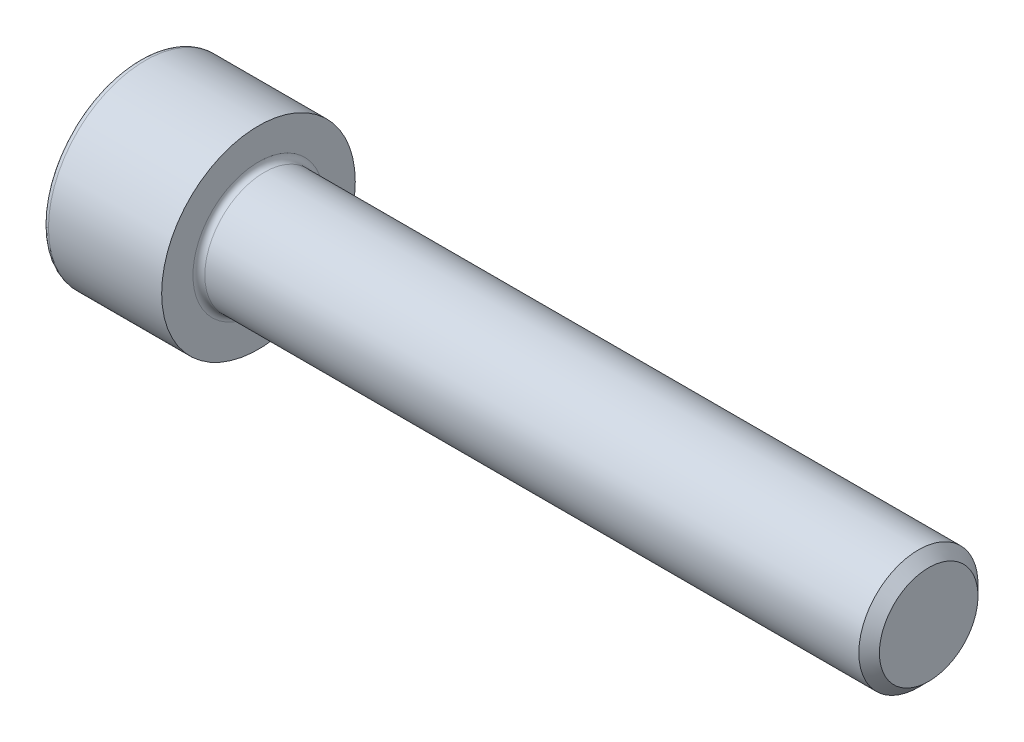
ISO-10303-21;
HEADER;
FILE_DESCRIPTION(('STEP AP214'),'2;1');
FILE_NAME('part.step','',(''),(''),'','','');
FILE_SCHEMA(('AUTOMOTIVE_DESIGN { 1 0 10303 214 1 1 1 1 }'));
ENDSEC;
DATA;
#1=APPLICATION_CONTEXT('core data for automotive mechanical design processes');
#2=APPLICATION_PROTOCOL_DEFINITION('international standard','automotive_design',2000,#1);
#3=PRODUCT_CONTEXT('',#1,'mechanical');
#4=PRODUCT('Part','Part','',(#3));
#5=PRODUCT_RELATED_PRODUCT_CATEGORY('part','',(#4));
#6=PRODUCT_DEFINITION_FORMATION('','',#4);
#7=PRODUCT_DEFINITION_CONTEXT('part definition',#1,'design');
#8=PRODUCT_DEFINITION('design','',#6,#7);
#9=PRODUCT_DEFINITION_SHAPE('','',#8);
#10=(LENGTH_UNIT() NAMED_UNIT(*) SI_UNIT(.MILLI.,.METRE.));
#11=(NAMED_UNIT(*) PLANE_ANGLE_UNIT() SI_UNIT($,.RADIAN.));
#12=(NAMED_UNIT(*) SI_UNIT($,.STERADIAN.) SOLID_ANGLE_UNIT());
#13=UNCERTAINTY_MEASURE_WITH_UNIT(LENGTH_MEASURE(1.E-05),#10,'distance_accuracy_value','');
#14=(GEOMETRIC_REPRESENTATION_CONTEXT(3) GLOBAL_UNCERTAINTY_ASSIGNED_CONTEXT((#13)) GLOBAL_UNIT_ASSIGNED_CONTEXT((#10,
#11,#12)) REPRESENTATION_CONTEXT('',''));
#15=CARTESIAN_POINT('',(0.,0.,0.));
#16=DIRECTION('',(0.,0.,1.));
#17=DIRECTION('',(1.,0.,0.));
#18=AXIS2_PLACEMENT_3D('',#15,#16,#17);
#19=CARTESIAN_POINT('',(0.,0.,0.));
#20=DIRECTION('',(-1.,0.,0.));
#21=DIRECTION('',(0.,0.,1.));
#22=AXIS2_PLACEMENT_3D('',#19,#20,#21);
#23=PLANE('',#22);
#24=DIRECTION('',(0.,-0.499999999999999,0.866025403784439));
#25=VECTOR('',#24,1.);
#26=CARTESIAN_POINT('',(0.,3.51894989071077,0.));
#27=LINE('',#26,#25);
#28=CARTESIAN_POINT('',(0.,3.51894989071077,0.));
#29=VERTEX_POINT('',#28);
#30=CARTESIAN_POINT('',(0.,1.75947494535538,3.0475));
#31=VERTEX_POINT('',#30);
#32=EDGE_CURVE('E259',#29,#31,#27,.T.);
#33=ORIENTED_EDGE('',*,*,#32,.T.);
#34=DIRECTION('',(0.,1.,0.));
#35=VECTOR('',#34,1.);
#36=CARTESIAN_POINT('',(0.,-1.75947494535538,3.0475));
#37=LINE('',#36,#35);
#38=CARTESIAN_POINT('',(0.,-1.75947494535538,3.0475));
#39=VERTEX_POINT('',#38);
#40=EDGE_CURVE('E131',#39,#31,#37,.T.);
#41=ORIENTED_EDGE('',*,*,#40,.F.);
#42=DIRECTION('',(0.,-0.500000000000001,-0.866025403784438));
#43=VECTOR('',#42,1.);
#44=CARTESIAN_POINT('',(0.,-1.75947494535538,3.0475));
#45=LINE('',#44,#43);
#46=CARTESIAN_POINT('',(0.,-3.51894989071077,0.));
#47=VERTEX_POINT('',#46);
#48=EDGE_CURVE('E262',#39,#47,#45,.T.);
#49=ORIENTED_EDGE('',*,*,#48,.T.);
#50=DIRECTION('',(0.,0.499999999999999,-0.866025403784439));
#51=VECTOR('',#50,1.);
#52=CARTESIAN_POINT('',(0.,-3.51894989071077,0.));
#53=LINE('',#52,#51);
#54=CARTESIAN_POINT('',(0.,-1.75947494535539,-3.0475));
#55=VERTEX_POINT('',#54);
#56=EDGE_CURVE('E265',#47,#55,#53,.T.);
#57=ORIENTED_EDGE('',*,*,#56,.T.);
#58=DIRECTION('',(0.,-1.,0.));
#59=VECTOR('',#58,1.);
#60=CARTESIAN_POINT('',(0.,1.75947494535538,-3.0475));
#61=LINE('',#60,#59);
#62=CARTESIAN_POINT('',(0.,1.75947494535538,-3.0475));
#63=VERTEX_POINT('',#62);
#64=EDGE_CURVE('E268',#63,#55,#61,.T.);
#65=ORIENTED_EDGE('',*,*,#64,.F.);
#66=DIRECTION('',(0.,-0.500000000000001,-0.866025403784438));
#67=VECTOR('',#66,1.);
#68=CARTESIAN_POINT('',(0.,3.51894989071077,0.));
#69=LINE('',#68,#67);
#70=EDGE_CURVE('E126',#29,#63,#69,.T.);
#71=ORIENTED_EDGE('',*,*,#70,.F.);
#72=EDGE_LOOP('',(#33,#41,#49,#57,#65,#71));
#73=FACE_BOUND('',#72,.T.);
#74=CARTESIAN_POINT('',(0.,0.,0.));
#75=DIRECTION('',(-1.,0.,0.));
#76=DIRECTION('',(0.,0.,1.));
#77=AXIS2_PLACEMENT_3D('',#74,#75,#76);
#78=CIRCLE('',#77,6.1);
#79=CARTESIAN_POINT('',(0.,0.,6.1));
#80=VERTEX_POINT('',#79);
#81=EDGE_CURVE('E43',#80,#80,#78,.T.);
#82=ORIENTED_EDGE('',*,*,#81,.T.);
#83=EDGE_LOOP('',(#82));
#84=FACE_BOUND('',#83,.T.);
#85=ADVANCED_FACE('F35',(#73,#84),#23,.T.);
#86=CARTESIAN_POINT('',(-31.75,0.,0.));
#87=DIRECTION('',(-1.,0.,0.));
#88=DIRECTION('',(0.,0.,1.));
#89=AXIS2_PLACEMENT_3D('',#86,#87,#88);
#90=CYLINDRICAL_SURFACE('',#89,6.5);
#91=CARTESIAN_POINT('',(0.399999999999998,0.,0.));
#92=DIRECTION('',(-1.,0.,0.));
#93=DIRECTION('',(0.,0.,1.));
#94=AXIS2_PLACEMENT_3D('',#91,#92,#93);
#95=CIRCLE('',#94,6.5);
#96=CARTESIAN_POINT('',(0.399999999999998,0.,6.5));
#97=VERTEX_POINT('',#96);
#98=EDGE_CURVE('E11',#97,#97,#95,.F.);
#99=ORIENTED_EDGE('',*,*,#98,.T.);
#100=EDGE_LOOP('',(#99));
#101=FACE_BOUND('',#100,.T.);
#102=CARTESIAN_POINT('',(8.,0.,0.));
#103=DIRECTION('',(-1.,0.,0.));
#104=DIRECTION('',(0.,0.,1.));
#105=AXIS2_PLACEMENT_3D('',#102,#103,#104);
#106=CIRCLE('',#105,6.5);
#107=CARTESIAN_POINT('',(8.,0.,6.5));
#108=VERTEX_POINT('',#107);
#109=EDGE_CURVE('E149',#108,#108,#106,.T.);
#110=ORIENTED_EDGE('',*,*,#109,.T.);
#111=EDGE_LOOP('',(#110));
#112=FACE_BOUND('',#111,.T.);
#113=ADVANCED_FACE('F173',(#101,#112),#90,.T.);
#114=CARTESIAN_POINT('',(8.,6.5,0.));
#115=DIRECTION('',(1.,0.,0.));
#116=DIRECTION('',(0.,0.,-1.));
#117=AXIS2_PLACEMENT_3D('',#114,#115,#116);
#118=PLANE('',#117);
#119=CARTESIAN_POINT('',(8.,0.,0.));
#120=DIRECTION('',(1.,0.,0.));
#121=DIRECTION('',(0.,0.,-1.));
#122=AXIS2_PLACEMENT_3D('',#119,#120,#121);
#123=CIRCLE('',#122,4.39999999999994);
#124=CARTESIAN_POINT('',(8.,0.,-4.39999999999994));
#125=VERTEX_POINT('',#124);
#126=EDGE_CURVE('E152',#125,#125,#123,.F.);
#127=ORIENTED_EDGE('',*,*,#126,.T.);
#128=EDGE_LOOP('',(#127));
#129=FACE_BOUND('',#128,.T.);
#130=ORIENTED_EDGE('',*,*,#109,.F.);
#131=EDGE_LOOP('',(#130));
#132=FACE_BOUND('',#131,.T.);
#133=ADVANCED_FACE('F179',(#129,#132),#118,.T.);
#134=CARTESIAN_POINT('',(-31.75,0.,0.));
#135=DIRECTION('',(-1.,0.,0.));
#136=DIRECTION('',(0.,0.,1.));
#137=AXIS2_PLACEMENT_3D('',#134,#135,#136);
#138=CYLINDRICAL_SURFACE('',#137,3.99999999999994);
#139=CARTESIAN_POINT('',(8.4,0.,0.));
#140=DIRECTION('',(1.,0.,0.));
#141=DIRECTION('',(0.,0.,-1.));
#142=AXIS2_PLACEMENT_3D('',#139,#140,#141);
#143=CIRCLE('',#142,3.99999999999994);
#144=CARTESIAN_POINT('',(8.4,0.,-3.99999999999994));
#145=VERTEX_POINT('',#144);
#146=EDGE_CURVE('E155',#145,#145,#143,.T.);
#147=ORIENTED_EDGE('',*,*,#146,.T.);
#148=EDGE_LOOP('',(#147));
#149=FACE_BOUND('',#148,.T.);
#150=CARTESIAN_POINT('',(52.3094999999999,0.,0.));
#151=DIRECTION('',(-1.,0.,0.));
#152=DIRECTION('',(0.,0.,1.));
#153=AXIS2_PLACEMENT_3D('',#150,#151,#152);
#154=CIRCLE('',#153,3.99999999999988);
#155=CARTESIAN_POINT('',(52.3094999999999,0.,3.99999999999988));
#156=VERTEX_POINT('',#155);
#157=EDGE_CURVE('E146',#156,#156,#154,.T.);
#158=ORIENTED_EDGE('',*,*,#157,.T.);
#159=EDGE_LOOP('',(#158));
#160=FACE_BOUND('',#159,.T.);
#161=ADVANCED_FACE('F185',(#149,#160),#138,.T.);
#162=CARTESIAN_POINT('',(53.,0.,0.));
#163=DIRECTION('',(-1.,0.,0.));
#164=DIRECTION('',(0.,0.,1.));
#165=AXIS2_PLACEMENT_3D('',#162,#163,#164);
#166=CONICAL_SURFACE('',#165,3.3095,0.785398163397282);
#167=ORIENTED_EDGE('',*,*,#157,.F.);
#168=EDGE_LOOP('',(#167));
#169=FACE_BOUND('',#168,.T.);
#170=CARTESIAN_POINT('',(53.,0.,0.));
#171=DIRECTION('',(-1.,0.,0.));
#172=DIRECTION('',(0.,0.,1.));
#173=AXIS2_PLACEMENT_3D('',#170,#171,#172);
#174=CIRCLE('',#173,3.3095);
#175=CARTESIAN_POINT('',(53.,0.,3.3095));
#176=VERTEX_POINT('',#175);
#177=EDGE_CURVE('E142',#176,#176,#174,.T.);
#178=ORIENTED_EDGE('',*,*,#177,.T.);
#179=EDGE_LOOP('',(#178));
#180=FACE_BOUND('',#179,.T.);
#181=ADVANCED_FACE('F189',(#169,#180),#166,.T.);
#182=CARTESIAN_POINT('',(53.,3.3095,0.));
#183=DIRECTION('',(1.,0.,0.));
#184=DIRECTION('',(0.,0.,-1.));
#185=AXIS2_PLACEMENT_3D('',#182,#183,#184);
#186=PLANE('',#185);
#187=ORIENTED_EDGE('',*,*,#177,.F.);
#188=EDGE_LOOP('',(#187));
#189=FACE_BOUND('',#188,.T.);
#190=ADVANCED_FACE('F169',(#189),#186,.T.);
#191=CARTESIAN_POINT('',(8.4,0.,0.));
#192=DIRECTION('',(1.,0.,0.));
#193=DIRECTION('',(0.,0.,-1.));
#194=AXIS2_PLACEMENT_3D('',#191,#192,#193);
#195=TOROIDAL_SURFACE('',#194,4.39999999999994,0.4);
#196=ORIENTED_EDGE('',*,*,#146,.F.);
#197=EDGE_LOOP('',(#196));
#198=FACE_BOUND('',#197,.T.);
#199=ORIENTED_EDGE('',*,*,#126,.F.);
#200=EDGE_LOOP('',(#199));
#201=FACE_BOUND('',#200,.T.);
#202=ADVANCED_FACE('F162',(#198,#201),#195,.F.);
#203=CARTESIAN_POINT('',(0.399999999999998,0.,0.));
#204=DIRECTION('',(-1.,0.,0.));
#205=DIRECTION('',(0.,0.,1.));
#206=AXIS2_PLACEMENT_3D('',#203,#204,#205);
#207=TOROIDAL_SURFACE('',#206,6.1,0.4);
#208=ORIENTED_EDGE('',*,*,#98,.F.);
#209=EDGE_LOOP('',(#208));
#210=FACE_BOUND('',#209,.T.);
#211=ORIENTED_EDGE('',*,*,#81,.F.);
#212=EDGE_LOOP('',(#211));
#213=FACE_BOUND('',#212,.T.);
#214=ADVANCED_FACE('F37',(#210,#213),#207,.T.);
#215=CARTESIAN_POINT('',(4.,3.51894989071077,0.));
#216=DIRECTION('',(0.,-0.866025403784439,-0.499999999999999));
#217=DIRECTION('',(0.,0.499999999999999,-0.866025403784439));
#218=AXIS2_PLACEMENT_3D('',#215,#216,#217);
#219=PLANE('',#218);
#220=ORIENTED_EDGE('',*,*,#32,.F.);
#221=DIRECTION('',(-1.,0.,0.));
#222=VECTOR('',#221,1.);
#223=CARTESIAN_POINT('',(4.,3.51894989071077,0.));
#224=LINE('',#223,#222);
#225=CARTESIAN_POINT('',(4.,3.51894989071077,0.));
#226=VERTEX_POINT('',#225);
#227=EDGE_CURVE('E249',#226,#29,#224,.T.);
#228=ORIENTED_EDGE('',*,*,#227,.F.);
#229=DIRECTION('',(0.,-0.499999999999999,0.866025403784439));
#230=VECTOR('',#229,1.);
#231=CARTESIAN_POINT('',(4.,3.51894989071077,0.));
#232=LINE('',#231,#230);
#233=CARTESIAN_POINT('',(4.,2.63921241803307,1.52375));
#234=VERTEX_POINT('',#233);
#235=EDGE_CURVE('E118',#226,#234,#232,.T.);
#236=ORIENTED_EDGE('',*,*,#235,.T.);
#237=CARTESIAN_POINT('',(4.,1.75947494535538,3.0475));
#238=VERTEX_POINT('',#237);
#239=EDGE_CURVE('E109',#234,#238,#232,.T.);
#240=ORIENTED_EDGE('',*,*,#239,.T.);
#241=DIRECTION('',(-1.,0.,0.));
#242=VECTOR('',#241,1.);
#243=CARTESIAN_POINT('',(4.,1.75947494535538,3.0475));
#244=LINE('',#243,#242);
#245=EDGE_CURVE('E123',#238,#31,#244,.T.);
#246=ORIENTED_EDGE('',*,*,#245,.T.);
#247=EDGE_LOOP('',(#220,#228,#236,#240,#246));
#248=FACE_BOUND('',#247,.T.);
#249=ADVANCED_FACE('F122',(#248),#219,.T.);
#250=CARTESIAN_POINT('',(4.,-1.75947494535538,3.0475));
#251=DIRECTION('',(0.,0.,1.));
#252=DIRECTION('',(0.,-1.,0.));
#253=AXIS2_PLACEMENT_3D('',#250,#251,#252);
#254=PLANE('',#253);
#255=ORIENTED_EDGE('',*,*,#40,.T.);
#256=ORIENTED_EDGE('',*,*,#245,.F.);
#257=DIRECTION('',(0.,1.,0.));
#258=VECTOR('',#257,1.);
#259=CARTESIAN_POINT('',(4.,-1.75947494535538,3.0475));
#260=LINE('',#259,#258);
#261=CARTESIAN_POINT('',(4.,0.,3.0475));
#262=VERTEX_POINT('',#261);
#263=EDGE_CURVE('E106',#262,#238,#260,.T.);
#264=ORIENTED_EDGE('',*,*,#263,.F.);
#265=CARTESIAN_POINT('',(4.,-1.75947494535538,3.0475));
#266=VERTEX_POINT('',#265);
#267=EDGE_CURVE('E117',#266,#262,#260,.T.);
#268=ORIENTED_EDGE('',*,*,#267,.F.);
#269=DIRECTION('',(-1.,0.,0.));
#270=VECTOR('',#269,1.);
#271=CARTESIAN_POINT('',(4.,-1.75947494535538,3.0475));
#272=LINE('',#271,#270);
#273=EDGE_CURVE('E133',#266,#39,#272,.T.);
#274=ORIENTED_EDGE('',*,*,#273,.T.);
#275=EDGE_LOOP('',(#255,#256,#264,#268,#274));
#276=FACE_BOUND('',#275,.T.);
#277=ADVANCED_FACE('F128',(#276),#254,.F.);
#278=CARTESIAN_POINT('',(4.,-1.75947494535538,3.0475));
#279=DIRECTION('',(0.,0.866025403784438,-0.500000000000001));
#280=DIRECTION('',(0.,0.500000000000001,0.866025403784438));
#281=AXIS2_PLACEMENT_3D('',#278,#279,#280);
#282=PLANE('',#281);
#283=ORIENTED_EDGE('',*,*,#48,.F.);
#284=ORIENTED_EDGE('',*,*,#273,.F.);
#285=DIRECTION('',(0.,-0.500000000000001,-0.866025403784438));
#286=VECTOR('',#285,1.);
#287=CARTESIAN_POINT('',(4.,-1.75947494535538,3.0475));
#288=LINE('',#287,#286);
#289=CARTESIAN_POINT('',(4.,-2.63921241803308,1.52375));
#290=VERTEX_POINT('',#289);
#291=EDGE_CURVE('E288',#266,#290,#288,.T.);
#292=ORIENTED_EDGE('',*,*,#291,.T.);
#293=CARTESIAN_POINT('',(4.,-3.51894989071077,0.));
#294=VERTEX_POINT('',#293);
#295=EDGE_CURVE('E277',#290,#294,#288,.T.);
#296=ORIENTED_EDGE('',*,*,#295,.T.);
#297=DIRECTION('',(-1.,0.,0.));
#298=VECTOR('',#297,1.);
#299=CARTESIAN_POINT('',(4.,-3.51894989071077,0.));
#300=LINE('',#299,#298);
#301=EDGE_CURVE('E138',#294,#47,#300,.T.);
#302=ORIENTED_EDGE('',*,*,#301,.T.);
#303=EDGE_LOOP('',(#283,#284,#292,#296,#302));
#304=FACE_BOUND('',#303,.T.);
#305=ADVANCED_FACE('F203',(#304),#282,.T.);
#306=CARTESIAN_POINT('',(4.,-3.51894989071077,0.));
#307=DIRECTION('',(0.,0.866025403784439,0.499999999999999));
#308=DIRECTION('',(0.,-0.499999999999999,0.866025403784439));
#309=AXIS2_PLACEMENT_3D('',#306,#307,#308);
#310=PLANE('',#309);
#311=ORIENTED_EDGE('',*,*,#56,.F.);
#312=ORIENTED_EDGE('',*,*,#301,.F.);
#313=DIRECTION('',(0.,0.499999999999999,-0.866025403784439));
#314=VECTOR('',#313,1.);
#315=CARTESIAN_POINT('',(4.,-3.51894989071077,0.));
#316=LINE('',#315,#314);
#317=CARTESIAN_POINT('',(4.,-2.63921241803308,-1.52375));
#318=VERTEX_POINT('',#317);
#319=EDGE_CURVE('E255',#294,#318,#316,.T.);
#320=ORIENTED_EDGE('',*,*,#319,.T.);
#321=CARTESIAN_POINT('',(4.,-1.75947494535539,-3.0475));
#322=VERTEX_POINT('',#321);
#323=EDGE_CURVE('E287',#318,#322,#316,.T.);
#324=ORIENTED_EDGE('',*,*,#323,.T.);
#325=DIRECTION('',(-1.,0.,0.));
#326=VECTOR('',#325,1.);
#327=CARTESIAN_POINT('',(4.,-1.75947494535539,-3.0475));
#328=LINE('',#327,#326);
#329=EDGE_CURVE('E248',#322,#55,#328,.T.);
#330=ORIENTED_EDGE('',*,*,#329,.T.);
#331=EDGE_LOOP('',(#311,#312,#320,#324,#330));
#332=FACE_BOUND('',#331,.T.);
#333=ADVANCED_FACE('F206',(#332),#310,.T.);
#334=CARTESIAN_POINT('',(4.,1.75947494535538,-3.0475));
#335=DIRECTION('',(0.,0.,-1.));
#336=DIRECTION('',(0.,1.,0.));
#337=AXIS2_PLACEMENT_3D('',#334,#335,#336);
#338=PLANE('',#337);
#339=ORIENTED_EDGE('',*,*,#64,.T.);
#340=ORIENTED_EDGE('',*,*,#329,.F.);
#341=DIRECTION('',(0.,-1.,0.));
#342=VECTOR('',#341,1.);
#343=CARTESIAN_POINT('',(4.,1.75947494535538,-3.0475));
#344=LINE('',#343,#342);
#345=CARTESIAN_POINT('',(4.,0.,-3.0475));
#346=VERTEX_POINT('',#345);
#347=EDGE_CURVE('E252',#346,#322,#344,.T.);
#348=ORIENTED_EDGE('',*,*,#347,.F.);
#349=CARTESIAN_POINT('',(4.,1.75947494535538,-3.0475));
#350=VERTEX_POINT('',#349);
#351=EDGE_CURVE('E50',#350,#346,#344,.T.);
#352=ORIENTED_EDGE('',*,*,#351,.F.);
#353=DIRECTION('',(-1.,0.,0.));
#354=VECTOR('',#353,1.);
#355=CARTESIAN_POINT('',(4.,1.75947494535538,-3.0475));
#356=LINE('',#355,#354);
#357=EDGE_CURVE('E245',#350,#63,#356,.T.);
#358=ORIENTED_EDGE('',*,*,#357,.T.);
#359=EDGE_LOOP('',(#339,#340,#348,#352,#358));
#360=FACE_BOUND('',#359,.T.);
#361=ADVANCED_FACE('F210',(#360),#338,.F.);
#362=CARTESIAN_POINT('',(4.,3.51894989071077,0.));
#363=DIRECTION('',(0.,0.866025403784438,-0.500000000000001));
#364=DIRECTION('',(0.,0.500000000000001,0.866025403784438));
#365=AXIS2_PLACEMENT_3D('',#362,#363,#364);
#366=PLANE('',#365);
#367=ORIENTED_EDGE('',*,*,#70,.T.);
#368=ORIENTED_EDGE('',*,*,#357,.F.);
#369=DIRECTION('',(0.,-0.500000000000001,-0.866025403784438));
#370=VECTOR('',#369,1.);
#371=CARTESIAN_POINT('',(4.,3.51894989071077,0.));
#372=LINE('',#371,#370);
#373=CARTESIAN_POINT('',(4.,2.63921241803307,-1.52375));
#374=VERTEX_POINT('',#373);
#375=EDGE_CURVE('E235',#374,#350,#372,.T.);
#376=ORIENTED_EDGE('',*,*,#375,.F.);
#377=EDGE_CURVE('E241',#226,#374,#372,.T.);
#378=ORIENTED_EDGE('',*,*,#377,.F.);
#379=ORIENTED_EDGE('',*,*,#227,.T.);
#380=EDGE_LOOP('',(#367,#368,#376,#378,#379));
#381=FACE_BOUND('',#380,.T.);
#382=ADVANCED_FACE('F214',(#381),#366,.F.);
#383=CARTESIAN_POINT('',(4.,3.51894989071077,0.));
#384=DIRECTION('',(1.,0.,0.));
#385=DIRECTION('',(0.,0.,-1.));
#386=AXIS2_PLACEMENT_3D('',#383,#384,#385);
#387=PLANE('',#386);
#388=ORIENTED_EDGE('',*,*,#347,.T.);
#389=ORIENTED_EDGE('',*,*,#323,.F.);
#390=CARTESIAN_POINT('',(4.,0.,0.));
#391=DIRECTION('',(-1.,0.,0.));
#392=DIRECTION('',(0.,0.,1.));
#393=AXIS2_PLACEMENT_3D('',#390,#391,#392);
#394=CIRCLE('',#393,3.0475);
#395=EDGE_CURVE('E283',#346,#318,#394,.T.);
#396=ORIENTED_EDGE('',*,*,#395,.F.);
#397=EDGE_LOOP('',(#388,#389,#396));
#398=FACE_BOUND('',#397,.T.);
#399=ADVANCED_FACE('F218',(#398),#387,.F.);
#400=ORIENTED_EDGE('',*,*,#319,.F.);
#401=ORIENTED_EDGE('',*,*,#295,.F.);
#402=EDGE_CURVE('E136',#318,#290,#394,.T.);
#403=ORIENTED_EDGE('',*,*,#402,.F.);
#404=EDGE_LOOP('',(#400,#401,#403));
#405=FACE_BOUND('',#404,.T.);
#406=ADVANCED_FACE('F221',(#405),#387,.F.);
#407=ORIENTED_EDGE('',*,*,#291,.F.);
#408=ORIENTED_EDGE('',*,*,#267,.T.);
#409=EDGE_CURVE('E132',#290,#262,#394,.T.);
#410=ORIENTED_EDGE('',*,*,#409,.F.);
#411=EDGE_LOOP('',(#407,#408,#410));
#412=FACE_BOUND('',#411,.T.);
#413=ADVANCED_FACE('F226',(#412),#387,.F.);
#414=ORIENTED_EDGE('',*,*,#263,.T.);
#415=ORIENTED_EDGE('',*,*,#239,.F.);
#416=EDGE_CURVE('E112',#262,#234,#394,.T.);
#417=ORIENTED_EDGE('',*,*,#416,.F.);
#418=EDGE_LOOP('',(#414,#415,#417));
#419=FACE_BOUND('',#418,.T.);
#420=ADVANCED_FACE('F108',(#419),#387,.F.);
#421=ORIENTED_EDGE('',*,*,#235,.F.);
#422=ORIENTED_EDGE('',*,*,#377,.T.);
#423=EDGE_CURVE('E143',#234,#374,#394,.T.);
#424=ORIENTED_EDGE('',*,*,#423,.F.);
#425=EDGE_LOOP('',(#421,#422,#424));
#426=FACE_BOUND('',#425,.T.);
#427=ADVANCED_FACE('F229',(#426),#387,.F.);
#428=ORIENTED_EDGE('',*,*,#375,.T.);
#429=ORIENTED_EDGE('',*,*,#351,.T.);
#430=EDGE_CURVE('E238',#374,#346,#394,.T.);
#431=ORIENTED_EDGE('',*,*,#430,.F.);
#432=EDGE_LOOP('',(#428,#429,#431));
#433=FACE_BOUND('',#432,.T.);
#434=ADVANCED_FACE('F199',(#433),#387,.F.);
#435=CARTESIAN_POINT('',(4.,0.,0.));
#436=DIRECTION('',(-1.,0.,0.));
#437=DIRECTION('',(0.,0.,1.));
#438=AXIS2_PLACEMENT_3D('',#435,#436,#437);
#439=CONICAL_SURFACE('',#438,3.0475,1.04719755119659);
#440=CARTESIAN_POINT('',(5.75947494535541,0.,0.));
#441=VERTEX_POINT('',#440);
#442=VERTEX_LOOP('',#441);
#443=FACE_BOUND('',#442,.T.);
#444=ORIENTED_EDGE('',*,*,#416,.T.);
#445=ORIENTED_EDGE('',*,*,#423,.T.);
#446=ORIENTED_EDGE('',*,*,#430,.T.);
#447=ORIENTED_EDGE('',*,*,#395,.T.);
#448=ORIENTED_EDGE('',*,*,#402,.T.);
#449=ORIENTED_EDGE('',*,*,#409,.T.);
#450=EDGE_LOOP('',(#444,#445,#446,#447,#448,#449));
#451=FACE_BOUND('',#450,.T.);
#452=ADVANCED_FACE('F197',(#443,#451),#439,.F.);
#453=CLOSED_SHELL('',(#85,#113,#133,#161,#181,#190,#202,#214,#249,#277,#305,#333,#361,#382,#399,
#406,#413,#420,#427,#434,#452));
#454=MANIFOLD_SOLID_BREP('B2',#453);
#455=ADVANCED_BREP_SHAPE_REPRESENTATION('',(#18,#454),#14);
#456=SHAPE_DEFINITION_REPRESENTATION(#9,#455);
ENDSEC;
END-ISO-10303-21;
